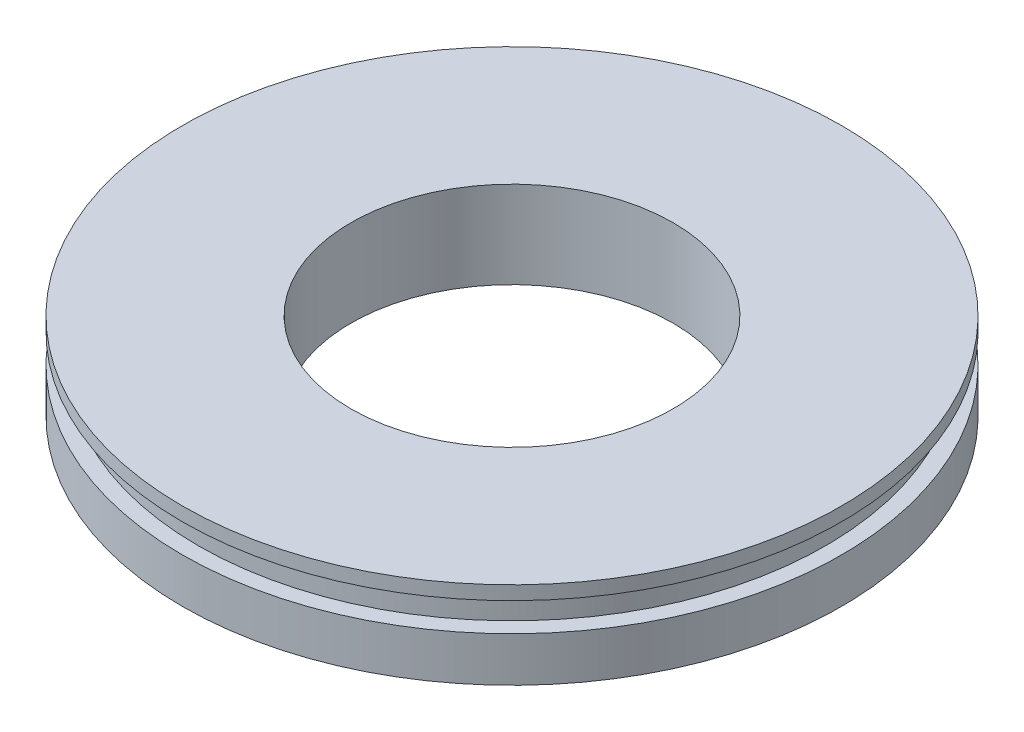
ISO-10303-21;
HEADER;
FILE_DESCRIPTION(('STEP AP214'),'2;1');
FILE_NAME('part.step','',(''),(''),'','','');
FILE_SCHEMA(('AUTOMOTIVE_DESIGN { 1 0 10303 214 1 1 1 1 }'));
ENDSEC;
DATA;
#1=APPLICATION_CONTEXT('core data for automotive mechanical design processes');
#2=APPLICATION_PROTOCOL_DEFINITION('international standard','automotive_design',2000,#1);
#3=PRODUCT_CONTEXT('',#1,'mechanical');
#4=PRODUCT('Part','Part','',(#3));
#5=PRODUCT_RELATED_PRODUCT_CATEGORY('part','',(#4));
#6=PRODUCT_DEFINITION_FORMATION('','',#4);
#7=PRODUCT_DEFINITION_CONTEXT('part definition',#1,'design');
#8=PRODUCT_DEFINITION('design','',#6,#7);
#9=PRODUCT_DEFINITION_SHAPE('','',#8);
#10=(LENGTH_UNIT() NAMED_UNIT(*) SI_UNIT(.MILLI.,.METRE.));
#11=(NAMED_UNIT(*) PLANE_ANGLE_UNIT() SI_UNIT($,.RADIAN.));
#12=(NAMED_UNIT(*) SI_UNIT($,.STERADIAN.) SOLID_ANGLE_UNIT());
#13=UNCERTAINTY_MEASURE_WITH_UNIT(LENGTH_MEASURE(1.E-05),#10,'distance_accuracy_value','');
#14=(GEOMETRIC_REPRESENTATION_CONTEXT(3) GLOBAL_UNCERTAINTY_ASSIGNED_CONTEXT((#13)) GLOBAL_UNIT_ASSIGNED_CONTEXT((#10,
#11,#12)) REPRESENTATION_CONTEXT('',''));
#15=CARTESIAN_POINT('',(0.,0.,0.));
#16=DIRECTION('',(0.,0.,1.));
#17=DIRECTION('',(1.,0.,0.));
#18=AXIS2_PLACEMENT_3D('',#15,#16,#17);
#19=CARTESIAN_POINT('',(0.,2.69408399999995,29.21));
#20=DIRECTION('',(0.,1.,0.));
#21=DIRECTION('',(0.,0.,1.));
#22=AXIS2_PLACEMENT_3D('',#19,#20,#21);
#23=PLANE('',#22);
#24=CARTESIAN_POINT('',(0.,2.69408399999995,0.));
#25=DIRECTION('',(0.,1.,0.));
#26=DIRECTION('',(0.,0.,1.));
#27=AXIS2_PLACEMENT_3D('',#24,#25,#26);
#28=CIRCLE('',#27,29.21);
#29=CARTESIAN_POINT('',(0.,2.69408399999995,29.21));
#30=VERTEX_POINT('',#29);
#31=EDGE_CURVE('E61',#30,#30,#28,.T.);
#32=ORIENTED_EDGE('',*,*,#31,.T.);
#33=EDGE_LOOP('',(#32));
#34=FACE_BOUND('',#33,.T.);
#35=CARTESIAN_POINT('',(0.,2.69408399999995,0.));
#36=DIRECTION('',(0.,1.,0.));
#37=DIRECTION('',(0.,0.,1.));
#38=AXIS2_PLACEMENT_3D('',#35,#36,#37);
#39=CIRCLE('',#38,14.2875);
#40=CARTESIAN_POINT('',(0.,2.69408399999995,14.2875));
#41=VERTEX_POINT('',#40);
#42=EDGE_CURVE('E10',#41,#41,#39,.T.);
#43=ORIENTED_EDGE('',*,*,#42,.F.);
#44=EDGE_LOOP('',(#43));
#45=FACE_BOUND('',#44,.T.);
#46=ADVANCED_FACE('F33',(#34,#45),#23,.T.);
#47=CARTESIAN_POINT('',(0.,0.,0.));
#48=DIRECTION('',(0.,1.,0.));
#49=DIRECTION('',(0.,0.,1.));
#50=AXIS2_PLACEMENT_3D('',#47,#48,#49);
#51=CYLINDRICAL_SURFACE('',#50,14.2875);
#52=ORIENTED_EDGE('',*,*,#42,.T.);
#53=EDGE_LOOP('',(#52));
#54=FACE_BOUND('',#53,.T.);
#55=CARTESIAN_POINT('',(0.,-5.02081799999997,0.));
#56=DIRECTION('',(0.,1.,0.));
#57=DIRECTION('',(0.,0.,1.));
#58=AXIS2_PLACEMENT_3D('',#55,#56,#57);
#59=CIRCLE('',#58,14.2875);
#60=CARTESIAN_POINT('',(0.,-5.02081799999997,14.2875));
#61=VERTEX_POINT('',#60);
#62=EDGE_CURVE('E39',#61,#61,#59,.T.);
#63=ORIENTED_EDGE('',*,*,#62,.F.);
#64=EDGE_LOOP('',(#63));
#65=FACE_BOUND('',#64,.T.);
#66=ADVANCED_FACE('F79',(#54,#65),#51,.F.);
#67=CARTESIAN_POINT('',(0.,-5.02081799999997,14.2875));
#68=DIRECTION('',(0.,-1.,0.));
#69=DIRECTION('',(0.,0.,-1.));
#70=AXIS2_PLACEMENT_3D('',#67,#68,#69);
#71=PLANE('',#70);
#72=ORIENTED_EDGE('',*,*,#62,.T.);
#73=EDGE_LOOP('',(#72));
#74=FACE_BOUND('',#73,.T.);
#75=CARTESIAN_POINT('',(0.,-5.02081799999997,0.));
#76=DIRECTION('',(0.,1.,0.));
#77=DIRECTION('',(0.,0.,1.));
#78=AXIS2_PLACEMENT_3D('',#75,#76,#77);
#79=CIRCLE('',#78,29.21);
#80=CARTESIAN_POINT('',(0.,-5.02081799999997,29.21));
#81=VERTEX_POINT('',#80);
#82=EDGE_CURVE('E43',#81,#81,#79,.T.);
#83=ORIENTED_EDGE('',*,*,#82,.F.);
#84=EDGE_LOOP('',(#83));
#85=FACE_BOUND('',#84,.T.);
#86=ADVANCED_FACE('F83',(#74,#85),#71,.T.);
#87=CARTESIAN_POINT('',(0.,0.,0.));
#88=DIRECTION('',(0.,1.,0.));
#89=DIRECTION('',(0.,0.,1.));
#90=AXIS2_PLACEMENT_3D('',#87,#88,#89);
#91=CYLINDRICAL_SURFACE('',#90,29.21);
#92=ORIENTED_EDGE('',*,*,#82,.T.);
#93=EDGE_LOOP('',(#92));
#94=FACE_BOUND('',#93,.T.);
#95=CARTESIAN_POINT('',(0.,-1.06206800000024,0.));
#96=DIRECTION('',(0.,1.,0.));
#97=DIRECTION('',(0.,0.,1.));
#98=AXIS2_PLACEMENT_3D('',#95,#96,#97);
#99=CIRCLE('',#98,29.21);
#100=CARTESIAN_POINT('',(0.,-1.06206800000024,29.21));
#101=VERTEX_POINT('',#100);
#102=EDGE_CURVE('E47',#101,#101,#99,.T.);
#103=ORIENTED_EDGE('',*,*,#102,.F.);
#104=EDGE_LOOP('',(#103));
#105=FACE_BOUND('',#104,.T.);
#106=ADVANCED_FACE('F87',(#94,#105),#91,.T.);
#107=CARTESIAN_POINT('',(0.,-1.06206800000024,29.21));
#108=DIRECTION('',(0.,1.,0.));
#109=DIRECTION('',(0.,0.,1.));
#110=AXIS2_PLACEMENT_3D('',#107,#108,#109);
#111=PLANE('',#110);
#112=ORIENTED_EDGE('',*,*,#102,.T.);
#113=EDGE_LOOP('',(#112));
#114=FACE_BOUND('',#113,.T.);
#115=CARTESIAN_POINT('',(0.,-1.06206800000024,0.));
#116=DIRECTION('',(0.,1.,0.));
#117=DIRECTION('',(0.,0.,1.));
#118=AXIS2_PLACEMENT_3D('',#115,#116,#117);
#119=CIRCLE('',#118,27.80411);
#120=CARTESIAN_POINT('',(0.,-1.06206800000024,27.80411));
#121=VERTEX_POINT('',#120);
#122=EDGE_CURVE('E52',#121,#121,#119,.T.);
#123=ORIENTED_EDGE('',*,*,#122,.F.);
#124=EDGE_LOOP('',(#123));
#125=FACE_BOUND('',#124,.T.);
#126=ADVANCED_FACE('F93',(#114,#125),#111,.T.);
#127=CARTESIAN_POINT('',(0.,0.,0.));
#128=DIRECTION('',(0.,1.,0.));
#129=DIRECTION('',(0.,0.,1.));
#130=AXIS2_PLACEMENT_3D('',#127,#128,#129);
#131=CYLINDRICAL_SURFACE('',#130,27.80411);
#132=ORIENTED_EDGE('',*,*,#122,.T.);
#133=EDGE_LOOP('',(#132));
#134=FACE_BOUND('',#133,.T.);
#135=CARTESIAN_POINT('',(0.,1.47793199999976,0.));
#136=DIRECTION('',(0.,1.,0.));
#137=DIRECTION('',(0.,0.,1.));
#138=AXIS2_PLACEMENT_3D('',#135,#136,#137);
#139=CIRCLE('',#138,27.80411);
#140=CARTESIAN_POINT('',(0.,1.47793199999976,27.80411));
#141=VERTEX_POINT('',#140);
#142=EDGE_CURVE('E55',#141,#141,#139,.T.);
#143=ORIENTED_EDGE('',*,*,#142,.F.);
#144=EDGE_LOOP('',(#143));
#145=FACE_BOUND('',#144,.T.);
#146=ADVANCED_FACE('F75',(#134,#145),#131,.T.);
#147=CARTESIAN_POINT('',(0.,1.47793199999976,27.80411));
#148=DIRECTION('',(0.,-1.,0.));
#149=DIRECTION('',(0.,0.,-1.));
#150=AXIS2_PLACEMENT_3D('',#147,#148,#149);
#151=PLANE('',#150);
#152=ORIENTED_EDGE('',*,*,#142,.T.);
#153=EDGE_LOOP('',(#152));
#154=FACE_BOUND('',#153,.T.);
#155=CARTESIAN_POINT('',(0.,1.47793199999976,0.));
#156=DIRECTION('',(0.,1.,0.));
#157=DIRECTION('',(0.,0.,1.));
#158=AXIS2_PLACEMENT_3D('',#155,#156,#157);
#159=CIRCLE('',#158,29.21);
#160=CARTESIAN_POINT('',(0.,1.47793199999976,29.21));
#161=VERTEX_POINT('',#160);
#162=EDGE_CURVE('E58',#161,#161,#159,.T.);
#163=ORIENTED_EDGE('',*,*,#162,.F.);
#164=EDGE_LOOP('',(#163));
#165=FACE_BOUND('',#164,.T.);
#166=ADVANCED_FACE('F69',(#154,#165),#151,.T.);
#167=CARTESIAN_POINT('',(0.,0.,0.));
#168=DIRECTION('',(0.,1.,0.));
#169=DIRECTION('',(0.,0.,1.));
#170=AXIS2_PLACEMENT_3D('',#167,#168,#169);
#171=CYLINDRICAL_SURFACE('',#170,29.21);
#172=ORIENTED_EDGE('',*,*,#162,.T.);
#173=EDGE_LOOP('',(#172));
#174=FACE_BOUND('',#173,.T.);
#175=ORIENTED_EDGE('',*,*,#31,.F.);
#176=EDGE_LOOP('',(#175));
#177=FACE_BOUND('',#176,.T.);
#178=ADVANCED_FACE('F67',(#174,#177),#171,.T.);
#179=CLOSED_SHELL('',(#46,#66,#86,#106,#126,#146,#166,#178));
#180=MANIFOLD_SOLID_BREP('B2',#179);
#181=ADVANCED_BREP_SHAPE_REPRESENTATION('',(#18,#180),#14);
#182=SHAPE_DEFINITION_REPRESENTATION(#9,#181);
ENDSEC;
END-ISO-10303-21;
